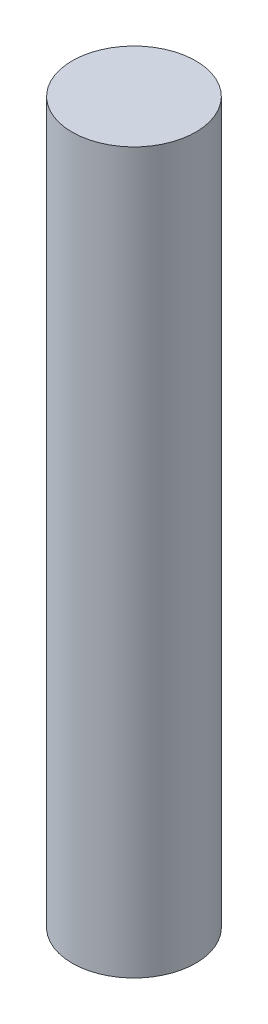
ISO-10303-21;
HEADER;
FILE_DESCRIPTION(('STEP AP214'),'2;1');
FILE_NAME('part.step','',(''),(''),'','','');
FILE_SCHEMA(('AUTOMOTIVE_DESIGN { 1 0 10303 214 1 1 1 1 }'));
ENDSEC;
DATA;
#1=APPLICATION_CONTEXT('core data for automotive mechanical design processes');
#2=APPLICATION_PROTOCOL_DEFINITION('international standard','automotive_design',2000,#1);
#3=PRODUCT_CONTEXT('',#1,'mechanical');
#4=PRODUCT('Part','Part','',(#3));
#5=PRODUCT_RELATED_PRODUCT_CATEGORY('part','',(#4));
#6=PRODUCT_DEFINITION_FORMATION('','',#4);
#7=PRODUCT_DEFINITION_CONTEXT('part definition',#1,'design');
#8=PRODUCT_DEFINITION('design','',#6,#7);
#9=PRODUCT_DEFINITION_SHAPE('','',#8);
#10=(LENGTH_UNIT() NAMED_UNIT(*) SI_UNIT(.MILLI.,.METRE.));
#11=(NAMED_UNIT(*) PLANE_ANGLE_UNIT() SI_UNIT($,.RADIAN.));
#12=(NAMED_UNIT(*) SI_UNIT($,.STERADIAN.) SOLID_ANGLE_UNIT());
#13=UNCERTAINTY_MEASURE_WITH_UNIT(LENGTH_MEASURE(1.E-05),#10,'distance_accuracy_value','');
#14=(GEOMETRIC_REPRESENTATION_CONTEXT(3) GLOBAL_UNCERTAINTY_ASSIGNED_CONTEXT((#13)) GLOBAL_UNIT_ASSIGNED_CONTEXT((#10,
#11,#12)) REPRESENTATION_CONTEXT('',''));
#15=CARTESIAN_POINT('',(0.,0.,0.));
#16=DIRECTION('',(0.,0.,1.));
#17=DIRECTION('',(1.,0.,0.));
#18=AXIS2_PLACEMENT_3D('',#15,#16,#17);
#19=CARTESIAN_POINT('',(0.,42.8625,0.));
#20=DIRECTION('',(0.,-1.,0.));
#21=DIRECTION('',(0.,0.,-1.));
#22=AXIS2_PLACEMENT_3D('',#19,#20,#21);
#23=CYLINDRICAL_SURFACE('',#22,3.68046);
#24=CARTESIAN_POINT('',(0.,42.8625,0.));
#25=DIRECTION('',(0.,1.,0.));
#26=DIRECTION('',(0.,0.,1.));
#27=AXIS2_PLACEMENT_3D('',#24,#25,#26);
#28=CIRCLE('',#27,3.68046);
#29=CARTESIAN_POINT('',(0.,42.8625,3.68046));
#30=VERTEX_POINT('',#29);
#31=EDGE_CURVE('E10',#30,#30,#28,.T.);
#32=ORIENTED_EDGE('',*,*,#31,.F.);
#33=EDGE_LOOP('',(#32));
#34=FACE_BOUND('',#33,.T.);
#35=CARTESIAN_POINT('',(0.,0.,0.));
#36=DIRECTION('',(0.,1.,0.));
#37=DIRECTION('',(0.,0.,1.));
#38=AXIS2_PLACEMENT_3D('',#35,#36,#37);
#39=CIRCLE('',#38,3.68046);
#40=CARTESIAN_POINT('',(0.,0.,3.68046));
#41=VERTEX_POINT('',#40);
#42=EDGE_CURVE('E34',#41,#41,#39,.T.);
#43=ORIENTED_EDGE('',*,*,#42,.T.);
#44=EDGE_LOOP('',(#43));
#45=FACE_BOUND('',#44,.T.);
#46=ADVANCED_FACE('F31',(#34,#45),#23,.T.);
#47=CARTESIAN_POINT('',(0.,42.8625,0.));
#48=DIRECTION('',(0.,1.,0.));
#49=DIRECTION('',(0.,0.,1.));
#50=AXIS2_PLACEMENT_3D('',#47,#48,#49);
#51=PLANE('',#50);
#52=ORIENTED_EDGE('',*,*,#31,.T.);
#53=EDGE_LOOP('',(#52));
#54=FACE_BOUND('',#53,.T.);
#55=ADVANCED_FACE('F46',(#54),#51,.T.);
#56=CARTESIAN_POINT('',(0.,0.,0.));
#57=DIRECTION('',(0.,1.,0.));
#58=DIRECTION('',(0.,0.,1.));
#59=AXIS2_PLACEMENT_3D('',#56,#57,#58);
#60=PLANE('',#59);
#61=ORIENTED_EDGE('',*,*,#42,.F.);
#62=EDGE_LOOP('',(#61));
#63=FACE_BOUND('',#62,.T.);
#64=ADVANCED_FACE('F44',(#63),#60,.F.);
#65=CLOSED_SHELL('',(#46,#55,#64));
#66=MANIFOLD_SOLID_BREP('B2',#65);
#67=ADVANCED_BREP_SHAPE_REPRESENTATION('',(#18,#66),#14);
#68=SHAPE_DEFINITION_REPRESENTATION(#9,#67);
ENDSEC;
END-ISO-10303-21;
